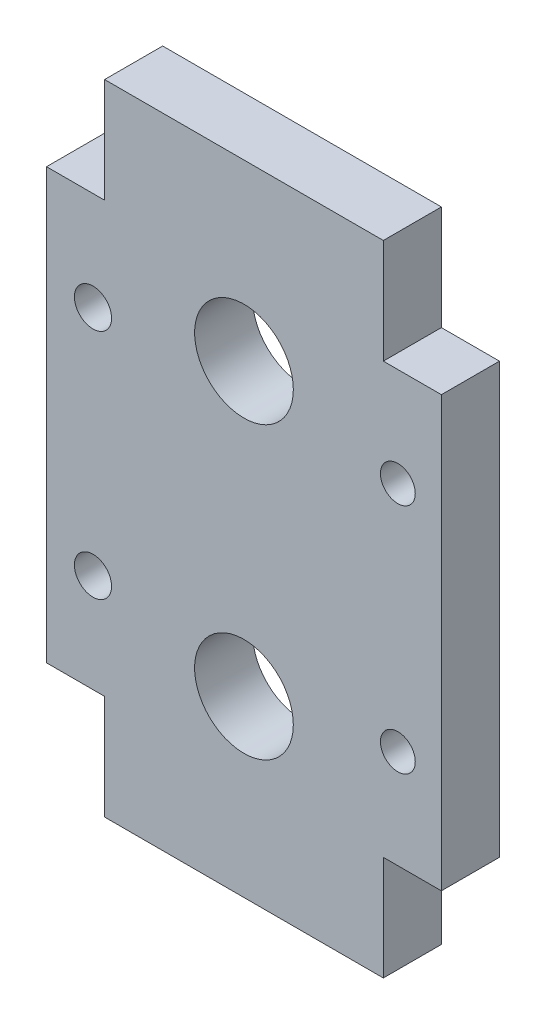
ISO-10303-21;
HEADER;
FILE_DESCRIPTION(('STEP AP214'),'2;1');
FILE_NAME('part.step','',(''),(''),'','','');
FILE_SCHEMA(('AUTOMOTIVE_DESIGN { 1 0 10303 214 1 1 1 1 }'));
ENDSEC;
DATA;
#1=APPLICATION_CONTEXT('core data for automotive mechanical design processes');
#2=APPLICATION_PROTOCOL_DEFINITION('international standard','automotive_design',2000,#1);
#3=PRODUCT_CONTEXT('',#1,'mechanical');
#4=PRODUCT('Part','Part','',(#3));
#5=PRODUCT_RELATED_PRODUCT_CATEGORY('part','',(#4));
#6=PRODUCT_DEFINITION_FORMATION('','',#4);
#7=PRODUCT_DEFINITION_CONTEXT('part definition',#1,'design');
#8=PRODUCT_DEFINITION('design','',#6,#7);
#9=PRODUCT_DEFINITION_SHAPE('','',#8);
#10=(LENGTH_UNIT() NAMED_UNIT(*) SI_UNIT(.MILLI.,.METRE.));
#11=(NAMED_UNIT(*) PLANE_ANGLE_UNIT() SI_UNIT($,.RADIAN.));
#12=(NAMED_UNIT(*) SI_UNIT($,.STERADIAN.) SOLID_ANGLE_UNIT());
#13=UNCERTAINTY_MEASURE_WITH_UNIT(LENGTH_MEASURE(1.E-05),#10,'distance_accuracy_value','');
#14=(GEOMETRIC_REPRESENTATION_CONTEXT(3) GLOBAL_UNCERTAINTY_ASSIGNED_CONTEXT((#13)) GLOBAL_UNIT_ASSIGNED_CONTEXT((#10,
#11,#12)) REPRESENTATION_CONTEXT('',''));
#15=CARTESIAN_POINT('',(0.,0.,0.));
#16=DIRECTION('',(0.,0.,1.));
#17=DIRECTION('',(1.,0.,0.));
#18=AXIS2_PLACEMENT_3D('',#15,#16,#17);
#19=CARTESIAN_POINT('',(16.700860260171,3.2922916539892,5.));
#20=DIRECTION('',(0.,0.,1.));
#21=DIRECTION('',(1.,0.,0.));
#22=AXIS2_PLACEMENT_3D('',#19,#20,#21);
#23=PLANE('',#22);
#24=DIRECTION('',(0.,1.,0.));
#25=VECTOR('',#24,1.);
#26=CARTESIAN_POINT('',(16.5009159395274,20.7922916539892,5.));
#27=LINE('',#26,#25);
#28=CARTESIAN_POINT('',(16.5009159395274,-16.2077083460108,5.));
#29=VERTEX_POINT('',#28);
#30=CARTESIAN_POINT('',(16.5009159395274,20.7922916539892,5.));
#31=VERTEX_POINT('',#30);
#32=EDGE_CURVE('E119',#29,#31,#27,.T.);
#33=ORIENTED_EDGE('',*,*,#32,.F.);
#34=DIRECTION('',(-1.,0.,0.));
#35=VECTOR('',#34,1.);
#36=CARTESIAN_POINT('',(16.700860260171,-16.2077083460108,5.));
#37=LINE('',#36,#35);
#38=CARTESIAN_POINT('',(21.5009159395274,-16.2077083460108,5.));
#39=VERTEX_POINT('',#38);
#40=EDGE_CURVE('E123',#39,#29,#37,.T.);
#41=ORIENTED_EDGE('',*,*,#40,.F.);
#42=DIRECTION('',(0.,1.,0.));
#43=VECTOR('',#42,1.);
#44=CARTESIAN_POINT('',(21.5009159395274,-25.2077083460108,5.));
#45=LINE('',#44,#43);
#46=CARTESIAN_POINT('',(21.5009159395274,-25.2077083460108,5.));
#47=VERTEX_POINT('',#46);
#48=EDGE_CURVE('E222',#47,#39,#45,.T.);
#49=ORIENTED_EDGE('',*,*,#48,.F.);
#50=DIRECTION('',(1.,0.,0.));
#51=VECTOR('',#50,1.);
#52=CARTESIAN_POINT('',(26.2509159395273,-25.2077083460108,5.));
#53=LINE('',#52,#51);
#54=CARTESIAN_POINT('',(45.5009159395274,-25.2077083460108,5.));
#55=VERTEX_POINT('',#54);
#56=EDGE_CURVE('E11',#47,#55,#53,.T.);
#57=ORIENTED_EDGE('',*,*,#56,.T.);
#58=DIRECTION('',(0.,-1.,0.));
#59=VECTOR('',#58,1.);
#60=CARTESIAN_POINT('',(45.5009159395274,-25.2077083460108,5.));
#61=LINE('',#60,#59);
#62=CARTESIAN_POINT('',(45.5009159395274,-16.2077083460108,5.));
#63=VERTEX_POINT('',#62);
#64=EDGE_CURVE('E213',#63,#55,#61,.T.);
#65=ORIENTED_EDGE('',*,*,#64,.F.);
#66=DIRECTION('',(-1.,0.,0.));
#67=VECTOR('',#66,1.);
#68=CARTESIAN_POINT('',(50.0009159395274,-16.2077083460108,5.));
#69=LINE('',#68,#67);
#70=CARTESIAN_POINT('',(50.5009159395274,-16.2077083460108,5.));
#71=VERTEX_POINT('',#70);
#72=EDGE_CURVE('E173',#71,#63,#69,.T.);
#73=ORIENTED_EDGE('',*,*,#72,.F.);
#74=DIRECTION('',(0.,-1.,0.));
#75=VECTOR('',#74,1.);
#76=CARTESIAN_POINT('',(50.5009159395274,-16.2077083460108,5.));
#77=LINE('',#76,#75);
#78=CARTESIAN_POINT('',(50.5009159395274,20.7922916539892,5.));
#79=VERTEX_POINT('',#78);
#80=EDGE_CURVE('E170',#79,#71,#77,.T.);
#81=ORIENTED_EDGE('',*,*,#80,.F.);
#82=DIRECTION('',(1.,0.,0.));
#83=VECTOR('',#82,1.);
#84=CARTESIAN_POINT('',(50.5009159395274,20.7922916539892,5.));
#85=LINE('',#84,#83);
#86=CARTESIAN_POINT('',(45.5009159395274,20.7922916539892,5.));
#87=VERTEX_POINT('',#86);
#88=EDGE_CURVE('E177',#87,#79,#85,.T.);
#89=ORIENTED_EDGE('',*,*,#88,.F.);
#90=DIRECTION('',(0.,-1.,0.));
#91=VECTOR('',#90,1.);
#92=CARTESIAN_POINT('',(45.5009159395274,29.1887382633958,5.));
#93=LINE('',#92,#91);
#94=CARTESIAN_POINT('',(45.5009159395274,29.7922916539892,5.));
#95=VERTEX_POINT('',#94);
#96=EDGE_CURVE('E199',#95,#87,#93,.T.);
#97=ORIENTED_EDGE('',*,*,#96,.F.);
#98=DIRECTION('',(1.,0.,0.));
#99=VECTOR('',#98,1.);
#100=CARTESIAN_POINT('',(45.5009159395274,29.7922916539892,5.));
#101=LINE('',#100,#99);
#102=CARTESIAN_POINT('',(21.5009159395274,29.7922916539892,5.));
#103=VERTEX_POINT('',#102);
#104=EDGE_CURVE('E195',#103,#95,#101,.T.);
#105=ORIENTED_EDGE('',*,*,#104,.F.);
#106=DIRECTION('',(0.,1.,0.));
#107=VECTOR('',#106,1.);
#108=CARTESIAN_POINT('',(21.5009159395274,29.7922916539892,5.));
#109=LINE('',#108,#107);
#110=CARTESIAN_POINT('',(21.5009159395274,20.7922916539891,5.));
#111=VERTEX_POINT('',#110);
#112=EDGE_CURVE('E192',#111,#103,#109,.T.);
#113=ORIENTED_EDGE('',*,*,#112,.F.);
#114=DIRECTION('',(1.,0.,0.));
#115=VECTOR('',#114,1.);
#116=CARTESIAN_POINT('',(16.700860260171,20.7922916539891,5.));
#117=LINE('',#116,#115);
#118=EDGE_CURVE('E125',#31,#111,#117,.T.);
#119=ORIENTED_EDGE('',*,*,#118,.F.);
#120=EDGE_LOOP('',(#33,#41,#49,#57,#65,#73,#81,#89,#97,#105,#113,#119));
#121=FACE_BOUND('',#120,.T.);
#122=CARTESIAN_POINT('',(20.5009159395274,-7.70770834601083,5.));
#123=DIRECTION('',(0.,0.,1.));
#124=DIRECTION('',(1.,0.,0.));
#125=AXIS2_PLACEMENT_3D('',#122,#123,#124);
#126=CIRCLE('',#125,1.6);
#127=CARTESIAN_POINT('',(22.1009159395274,-7.70770834601083,5.));
#128=VERTEX_POINT('',#127);
#129=EDGE_CURVE('E354',#128,#128,#126,.T.);
#130=ORIENTED_EDGE('',*,*,#129,.F.);
#131=EDGE_LOOP('',(#130));
#132=FACE_BOUND('',#131,.T.);
#133=CARTESIAN_POINT('',(20.5009159395274,12.2922916539892,5.));
#134=DIRECTION('',(0.,0.,1.));
#135=DIRECTION('',(1.,0.,0.));
#136=AXIS2_PLACEMENT_3D('',#133,#134,#135);
#137=CIRCLE('',#136,1.6);
#138=CARTESIAN_POINT('',(22.1009159395274,12.2922916539892,5.));
#139=VERTEX_POINT('',#138);
#140=EDGE_CURVE('E356',#139,#139,#137,.T.);
#141=ORIENTED_EDGE('',*,*,#140,.F.);
#142=EDGE_LOOP('',(#141));
#143=FACE_BOUND('',#142,.T.);
#144=CARTESIAN_POINT('',(33.5009159395274,-10.2077083460108,5.));
#145=DIRECTION('',(0.,0.,1.));
#146=DIRECTION('',(1.,0.,0.));
#147=AXIS2_PLACEMENT_3D('',#144,#145,#146);
#148=CIRCLE('',#147,4.25000000000001);
#149=CARTESIAN_POINT('',(37.7509159395274,-10.2077083460108,5.));
#150=VERTEX_POINT('',#149);
#151=EDGE_CURVE('E228',#150,#150,#148,.T.);
#152=ORIENTED_EDGE('',*,*,#151,.F.);
#153=EDGE_LOOP('',(#152));
#154=FACE_BOUND('',#153,.T.);
#155=CARTESIAN_POINT('',(46.7509159395274,12.2922916539892,5.));
#156=DIRECTION('',(0.,0.,1.));
#157=DIRECTION('',(1.,0.,0.));
#158=AXIS2_PLACEMENT_3D('',#155,#156,#157);
#159=CIRCLE('',#158,1.5);
#160=CARTESIAN_POINT('',(48.2509159395274,12.2922916539892,5.));
#161=VERTEX_POINT('',#160);
#162=EDGE_CURVE('E240',#161,#161,#159,.T.);
#163=ORIENTED_EDGE('',*,*,#162,.F.);
#164=EDGE_LOOP('',(#163));
#165=FACE_BOUND('',#164,.T.);
#166=CARTESIAN_POINT('',(46.7509159395274,-7.70770834601081,5.));
#167=DIRECTION('',(0.,0.,1.));
#168=DIRECTION('',(1.,0.,0.));
#169=AXIS2_PLACEMENT_3D('',#166,#167,#168);
#170=CIRCLE('',#169,1.5);
#171=CARTESIAN_POINT('',(48.2509159395274,-7.70770834601081,5.));
#172=VERTEX_POINT('',#171);
#173=EDGE_CURVE('E246',#172,#172,#170,.T.);
#174=ORIENTED_EDGE('',*,*,#173,.F.);
#175=EDGE_LOOP('',(#174));
#176=FACE_BOUND('',#175,.T.);
#177=CARTESIAN_POINT('',(33.5009159395274,14.7922916539892,5.));
#178=DIRECTION('',(0.,0.,1.));
#179=DIRECTION('',(1.,0.,0.));
#180=AXIS2_PLACEMENT_3D('',#177,#178,#179);
#181=CIRCLE('',#180,4.25);
#182=CARTESIAN_POINT('',(37.7509159395274,14.7922916539892,5.));
#183=VERTEX_POINT('',#182);
#184=EDGE_CURVE('E234',#183,#183,#181,.T.);
#185=ORIENTED_EDGE('',*,*,#184,.F.);
#186=EDGE_LOOP('',(#185));
#187=FACE_BOUND('',#186,.T.);
#188=ADVANCED_FACE('F35',(#121,#132,#143,#154,#165,#176,#187),#23,.T.);
#189=CARTESIAN_POINT('',(16.700860260171,3.2922916539892,0.));
#190=DIRECTION('',(0.,0.,1.));
#191=DIRECTION('',(1.,0.,0.));
#192=AXIS2_PLACEMENT_3D('',#189,#190,#191);
#193=PLANE('',#192);
#194=DIRECTION('',(1.,0.,0.));
#195=VECTOR('',#194,1.);
#196=CARTESIAN_POINT('',(21.2509159395274,-16.2077083460108,0.));
#197=LINE('',#196,#195);
#198=CARTESIAN_POINT('',(16.5009159395274,-16.2077083460108,0.));
#199=VERTEX_POINT('',#198);
#200=CARTESIAN_POINT('',(21.5009159395274,-16.2077083460108,0.));
#201=VERTEX_POINT('',#200);
#202=EDGE_CURVE('E160',#199,#201,#197,.T.);
#203=ORIENTED_EDGE('',*,*,#202,.F.);
#204=DIRECTION('',(0.,1.,0.));
#205=VECTOR('',#204,1.);
#206=CARTESIAN_POINT('',(16.5009159395274,20.7922916539892,0.));
#207=LINE('',#206,#205);
#208=CARTESIAN_POINT('',(16.5009159395274,20.7922916539892,0.));
#209=VERTEX_POINT('',#208);
#210=EDGE_CURVE('E131',#199,#209,#207,.T.);
#211=ORIENTED_EDGE('',*,*,#210,.T.);
#212=DIRECTION('',(-1.,0.,0.));
#213=VECTOR('',#212,1.);
#214=CARTESIAN_POINT('',(21.5009159395274,20.7922916539891,0.));
#215=LINE('',#214,#213);
#216=CARTESIAN_POINT('',(21.5009159395274,20.7922916539891,0.));
#217=VERTEX_POINT('',#216);
#218=EDGE_CURVE('E155',#217,#209,#215,.T.);
#219=ORIENTED_EDGE('',*,*,#218,.F.);
#220=DIRECTION('',(0.,1.,0.));
#221=VECTOR('',#220,1.);
#222=CARTESIAN_POINT('',(21.5009159395274,29.7922916539892,0.));
#223=LINE('',#222,#221);
#224=CARTESIAN_POINT('',(21.5009159395274,29.7922916539892,0.));
#225=VERTEX_POINT('',#224);
#226=EDGE_CURVE('E190',#217,#225,#223,.T.);
#227=ORIENTED_EDGE('',*,*,#226,.T.);
#228=DIRECTION('',(1.,0.,0.));
#229=VECTOR('',#228,1.);
#230=CARTESIAN_POINT('',(45.5009159395274,29.7922916539892,0.));
#231=LINE('',#230,#229);
#232=CARTESIAN_POINT('',(45.5009159395274,29.7922916539892,0.));
#233=VERTEX_POINT('',#232);
#234=EDGE_CURVE('E205',#225,#233,#231,.T.);
#235=ORIENTED_EDGE('',*,*,#234,.T.);
#236=DIRECTION('',(0.,-1.,0.));
#237=VECTOR('',#236,1.);
#238=CARTESIAN_POINT('',(45.5009159395274,29.1887382633958,0.));
#239=LINE('',#238,#237);
#240=CARTESIAN_POINT('',(45.5009159395274,20.7922916539892,0.));
#241=VERTEX_POINT('',#240);
#242=EDGE_CURVE('E196',#233,#241,#239,.T.);
#243=ORIENTED_EDGE('',*,*,#242,.T.);
#244=DIRECTION('',(1.,0.,0.));
#245=VECTOR('',#244,1.);
#246=CARTESIAN_POINT('',(50.5009159395274,20.7922916539892,0.));
#247=LINE('',#246,#245);
#248=CARTESIAN_POINT('',(50.5009159395274,20.7922916539892,0.));
#249=VERTEX_POINT('',#248);
#250=EDGE_CURVE('E174',#241,#249,#247,.T.);
#251=ORIENTED_EDGE('',*,*,#250,.T.);
#252=DIRECTION('',(0.,-1.,0.));
#253=VECTOR('',#252,1.);
#254=CARTESIAN_POINT('',(50.5009159395274,-16.2077083460108,0.));
#255=LINE('',#254,#253);
#256=CARTESIAN_POINT('',(50.5009159395274,-16.2077083460108,0.));
#257=VERTEX_POINT('',#256);
#258=EDGE_CURVE('E169',#249,#257,#255,.T.);
#259=ORIENTED_EDGE('',*,*,#258,.T.);
#260=DIRECTION('',(-1.,0.,0.));
#261=VECTOR('',#260,1.);
#262=CARTESIAN_POINT('',(50.0009159395274,-16.2077083460108,0.));
#263=LINE('',#262,#261);
#264=CARTESIAN_POINT('',(45.5009159395274,-16.2077083460108,0.));
#265=VERTEX_POINT('',#264);
#266=EDGE_CURVE('E183',#257,#265,#263,.T.);
#267=ORIENTED_EDGE('',*,*,#266,.T.);
#268=DIRECTION('',(0.,-1.,0.));
#269=VECTOR('',#268,1.);
#270=CARTESIAN_POINT('',(45.5009159395274,-25.2077083460108,0.));
#271=LINE('',#270,#269);
#272=CARTESIAN_POINT('',(45.5009159395274,-25.2077083460108,0.));
#273=VERTEX_POINT('',#272);
#274=EDGE_CURVE('E211',#265,#273,#271,.T.);
#275=ORIENTED_EDGE('',*,*,#274,.T.);
#276=DIRECTION('',(1.,0.,0.));
#277=VECTOR('',#276,1.);
#278=CARTESIAN_POINT('',(26.2509159395273,-25.2077083460108,0.));
#279=LINE('',#278,#277);
#280=CARTESIAN_POINT('',(21.5009159395274,-25.2077083460108,0.));
#281=VERTEX_POINT('',#280);
#282=EDGE_CURVE('E39',#281,#273,#279,.T.);
#283=ORIENTED_EDGE('',*,*,#282,.F.);
#284=DIRECTION('',(0.,1.,0.));
#285=VECTOR('',#284,1.);
#286=CARTESIAN_POINT('',(21.5009159395274,-25.2077083460108,0.));
#287=LINE('',#286,#285);
#288=EDGE_CURVE('E221',#281,#201,#287,.T.);
#289=ORIENTED_EDGE('',*,*,#288,.T.);
#290=EDGE_LOOP('',(#203,#211,#219,#227,#235,#243,#251,#259,#267,#275,#283,#289));
#291=FACE_BOUND('',#290,.T.);
#292=CARTESIAN_POINT('',(46.7509159395274,-7.70770834601081,0.));
#293=DIRECTION('',(0.,0.,1.));
#294=DIRECTION('',(1.,0.,0.));
#295=AXIS2_PLACEMENT_3D('',#292,#293,#294);
#296=CIRCLE('',#295,1.5);
#297=CARTESIAN_POINT('',(48.2509159395274,-7.70770834601081,0.));
#298=VERTEX_POINT('',#297);
#299=EDGE_CURVE('E243',#298,#298,#296,.T.);
#300=ORIENTED_EDGE('',*,*,#299,.T.);
#301=EDGE_LOOP('',(#300));
#302=FACE_BOUND('',#301,.T.);
#303=CARTESIAN_POINT('',(46.7509159395274,12.2922916539892,0.));
#304=DIRECTION('',(0.,0.,1.));
#305=DIRECTION('',(1.,0.,0.));
#306=AXIS2_PLACEMENT_3D('',#303,#304,#305);
#307=CIRCLE('',#306,1.5);
#308=CARTESIAN_POINT('',(48.2509159395274,12.2922916539892,0.));
#309=VERTEX_POINT('',#308);
#310=EDGE_CURVE('E237',#309,#309,#307,.T.);
#311=ORIENTED_EDGE('',*,*,#310,.T.);
#312=EDGE_LOOP('',(#311));
#313=FACE_BOUND('',#312,.T.);
#314=CARTESIAN_POINT('',(33.5009159395274,14.7922916539892,0.));
#315=DIRECTION('',(0.,0.,1.));
#316=DIRECTION('',(1.,0.,0.));
#317=AXIS2_PLACEMENT_3D('',#314,#315,#316);
#318=CIRCLE('',#317,4.25);
#319=CARTESIAN_POINT('',(37.7509159395274,14.7922916539892,0.));
#320=VERTEX_POINT('',#319);
#321=EDGE_CURVE('E231',#320,#320,#318,.T.);
#322=ORIENTED_EDGE('',*,*,#321,.T.);
#323=EDGE_LOOP('',(#322));
#324=FACE_BOUND('',#323,.T.);
#325=CARTESIAN_POINT('',(33.5009159395274,-10.2077083460108,0.));
#326=DIRECTION('',(0.,0.,1.));
#327=DIRECTION('',(1.,0.,0.));
#328=AXIS2_PLACEMENT_3D('',#325,#326,#327);
#329=CIRCLE('',#328,4.25000000000001);
#330=CARTESIAN_POINT('',(37.7509159395274,-10.2077083460108,0.));
#331=VERTEX_POINT('',#330);
#332=EDGE_CURVE('E227',#331,#331,#329,.T.);
#333=ORIENTED_EDGE('',*,*,#332,.T.);
#334=EDGE_LOOP('',(#333));
#335=FACE_BOUND('',#334,.T.);
#336=CARTESIAN_POINT('',(20.5009159395274,12.2922916539892,0.));
#337=DIRECTION('',(0.,0.,1.));
#338=DIRECTION('',(1.,0.,0.));
#339=AXIS2_PLACEMENT_3D('',#336,#337,#338);
#340=CIRCLE('',#339,1.6);
#341=CARTESIAN_POINT('',(22.1009159395274,12.2922916539892,0.));
#342=VERTEX_POINT('',#341);
#343=EDGE_CURVE('E146',#342,#342,#340,.T.);
#344=ORIENTED_EDGE('',*,*,#343,.T.);
#345=EDGE_LOOP('',(#344));
#346=FACE_BOUND('',#345,.T.);
#347=CARTESIAN_POINT('',(20.5009159395274,-7.70770834601083,0.));
#348=DIRECTION('',(0.,0.,1.));
#349=DIRECTION('',(1.,0.,0.));
#350=AXIS2_PLACEMENT_3D('',#347,#348,#349);
#351=CIRCLE('',#350,1.6);
#352=CARTESIAN_POINT('',(22.1009159395274,-7.70770834601083,0.));
#353=VERTEX_POINT('',#352);
#354=EDGE_CURVE('E150',#353,#353,#351,.T.);
#355=ORIENTED_EDGE('',*,*,#354,.T.);
#356=EDGE_LOOP('',(#355));
#357=FACE_BOUND('',#356,.T.);
#358=ADVANCED_FACE('F252',(#291,#302,#313,#324,#335,#346,#357),#193,.F.);
#359=CARTESIAN_POINT('',(26.2509159395273,-25.2077083460108,5.));
#360=DIRECTION('',(0.,1.,0.));
#361=DIRECTION('',(0.,0.,1.));
#362=AXIS2_PLACEMENT_3D('',#359,#360,#361);
#363=PLANE('',#362);
#364=ORIENTED_EDGE('',*,*,#282,.T.);
#365=DIRECTION('',(0.,0.,-1.));
#366=VECTOR('',#365,1.);
#367=CARTESIAN_POINT('',(45.5009159395274,-25.2077083460108,5.));
#368=LINE('',#367,#366);
#369=EDGE_CURVE('E216',#55,#273,#368,.T.);
#370=ORIENTED_EDGE('',*,*,#369,.F.);
#371=ORIENTED_EDGE('',*,*,#56,.F.);
#372=DIRECTION('',(0.,0.,-1.));
#373=VECTOR('',#372,1.);
#374=CARTESIAN_POINT('',(21.5009159395274,-25.2077083460108,5.));
#375=LINE('',#374,#373);
#376=EDGE_CURVE('E224',#47,#281,#375,.T.);
#377=ORIENTED_EDGE('',*,*,#376,.T.);
#378=EDGE_LOOP('',(#364,#370,#371,#377));
#379=FACE_BOUND('',#378,.T.);
#380=ADVANCED_FACE('F37',(#379),#363,.F.);
#381=CARTESIAN_POINT('',(46.7509159395274,-7.70770834601081,5.));
#382=DIRECTION('',(0.,0.,-1.));
#383=DIRECTION('',(-1.,0.,0.));
#384=AXIS2_PLACEMENT_3D('',#381,#382,#383);
#385=CYLINDRICAL_SURFACE('',#384,1.5);
#386=ORIENTED_EDGE('',*,*,#173,.T.);
#387=EDGE_LOOP('',(#386));
#388=FACE_BOUND('',#387,.T.);
#389=ORIENTED_EDGE('',*,*,#299,.F.);
#390=EDGE_LOOP('',(#389));
#391=FACE_BOUND('',#390,.T.);
#392=ADVANCED_FACE('F255',(#388,#391),#385,.F.);
#393=CARTESIAN_POINT('',(46.7509159395274,12.2922916539892,5.));
#394=DIRECTION('',(0.,0.,-1.));
#395=DIRECTION('',(-1.,0.,0.));
#396=AXIS2_PLACEMENT_3D('',#393,#394,#395);
#397=CYLINDRICAL_SURFACE('',#396,1.5);
#398=ORIENTED_EDGE('',*,*,#162,.T.);
#399=EDGE_LOOP('',(#398));
#400=FACE_BOUND('',#399,.T.);
#401=ORIENTED_EDGE('',*,*,#310,.F.);
#402=EDGE_LOOP('',(#401));
#403=FACE_BOUND('',#402,.T.);
#404=ADVANCED_FACE('F257',(#400,#403),#397,.F.);
#405=CARTESIAN_POINT('',(33.5009159395274,14.7922916539892,5.));
#406=DIRECTION('',(0.,0.,-1.));
#407=DIRECTION('',(-1.,0.,0.));
#408=AXIS2_PLACEMENT_3D('',#405,#406,#407);
#409=CYLINDRICAL_SURFACE('',#408,4.25);
#410=ORIENTED_EDGE('',*,*,#184,.T.);
#411=EDGE_LOOP('',(#410));
#412=FACE_BOUND('',#411,.T.);
#413=ORIENTED_EDGE('',*,*,#321,.F.);
#414=EDGE_LOOP('',(#413));
#415=FACE_BOUND('',#414,.T.);
#416=ADVANCED_FACE('F264',(#412,#415),#409,.F.);
#417=CARTESIAN_POINT('',(33.5009159395274,-10.2077083460108,5.));
#418=DIRECTION('',(0.,0.,-1.));
#419=DIRECTION('',(-1.,0.,0.));
#420=AXIS2_PLACEMENT_3D('',#417,#418,#419);
#421=CYLINDRICAL_SURFACE('',#420,4.25000000000001);
#422=ORIENTED_EDGE('',*,*,#151,.T.);
#423=EDGE_LOOP('',(#422));
#424=FACE_BOUND('',#423,.T.);
#425=ORIENTED_EDGE('',*,*,#332,.F.);
#426=EDGE_LOOP('',(#425));
#427=FACE_BOUND('',#426,.T.);
#428=ADVANCED_FACE('F334',(#424,#427),#421,.F.);
#429=CARTESIAN_POINT('',(21.5009159395274,-25.2077083460108,5.));
#430=DIRECTION('',(-1.,0.,0.));
#431=DIRECTION('',(0.,-1.,0.));
#432=AXIS2_PLACEMENT_3D('',#429,#430,#431);
#433=PLANE('',#432);
#434=ORIENTED_EDGE('',*,*,#288,.F.);
#435=ORIENTED_EDGE('',*,*,#376,.F.);
#436=ORIENTED_EDGE('',*,*,#48,.T.);
#437=DIRECTION('',(0.,0.,-1.));
#438=VECTOR('',#437,1.);
#439=CARTESIAN_POINT('',(21.5009159395274,-16.2077083460108,10.));
#440=LINE('',#439,#438);
#441=EDGE_CURVE('E140',#39,#201,#440,.T.);
#442=ORIENTED_EDGE('',*,*,#441,.T.);
#443=EDGE_LOOP('',(#434,#435,#436,#442));
#444=FACE_BOUND('',#443,.T.);
#445=ADVANCED_FACE('F280',(#444),#433,.T.);
#446=CARTESIAN_POINT('',(45.5009159395274,-25.2077083460108,5.));
#447=DIRECTION('',(1.,0.,0.));
#448=DIRECTION('',(0.,0.,-1.));
#449=AXIS2_PLACEMENT_3D('',#446,#447,#448);
#450=PLANE('',#449);
#451=ORIENTED_EDGE('',*,*,#274,.F.);
#452=DIRECTION('',(0.,0.,-1.));
#453=VECTOR('',#452,1.);
#454=CARTESIAN_POINT('',(45.5009159395274,-16.2077083460108,10.));
#455=LINE('',#454,#453);
#456=EDGE_CURVE('E141',#63,#265,#455,.T.);
#457=ORIENTED_EDGE('',*,*,#456,.F.);
#458=ORIENTED_EDGE('',*,*,#64,.T.);
#459=ORIENTED_EDGE('',*,*,#369,.T.);
#460=EDGE_LOOP('',(#451,#457,#458,#459));
#461=FACE_BOUND('',#460,.T.);
#462=ADVANCED_FACE('F284',(#461),#450,.T.);
#463=CARTESIAN_POINT('',(45.5009159395274,29.1887382633958,5.));
#464=DIRECTION('',(1.,0.,0.));
#465=DIRECTION('',(0.,0.,-1.));
#466=AXIS2_PLACEMENT_3D('',#463,#464,#465);
#467=PLANE('',#466);
#468=ORIENTED_EDGE('',*,*,#242,.F.);
#469=DIRECTION('',(0.,0.,-1.));
#470=VECTOR('',#469,1.);
#471=CARTESIAN_POINT('',(45.5009159395274,29.7922916539892,5.));
#472=LINE('',#471,#470);
#473=EDGE_CURVE('E209',#95,#233,#472,.T.);
#474=ORIENTED_EDGE('',*,*,#473,.F.);
#475=ORIENTED_EDGE('',*,*,#96,.T.);
#476=DIRECTION('',(0.,0.,-1.));
#477=VECTOR('',#476,1.);
#478=CARTESIAN_POINT('',(45.5009159395274,20.7922916539892,10.));
#479=LINE('',#478,#477);
#480=EDGE_CURVE('E161',#87,#241,#479,.T.);
#481=ORIENTED_EDGE('',*,*,#480,.T.);
#482=EDGE_LOOP('',(#468,#474,#475,#481));
#483=FACE_BOUND('',#482,.T.);
#484=ADVANCED_FACE('F300',(#483),#467,.T.);
#485=CARTESIAN_POINT('',(45.5009159395274,29.7922916539892,5.));
#486=DIRECTION('',(0.,1.,0.));
#487=DIRECTION('',(-1.,0.,0.));
#488=AXIS2_PLACEMENT_3D('',#485,#486,#487);
#489=PLANE('',#488);
#490=ORIENTED_EDGE('',*,*,#234,.F.);
#491=DIRECTION('',(0.,0.,-1.));
#492=VECTOR('',#491,1.);
#493=CARTESIAN_POINT('',(21.5009159395274,29.7922916539892,5.));
#494=LINE('',#493,#492);
#495=EDGE_CURVE('E202',#103,#225,#494,.T.);
#496=ORIENTED_EDGE('',*,*,#495,.F.);
#497=ORIENTED_EDGE('',*,*,#104,.T.);
#498=ORIENTED_EDGE('',*,*,#473,.T.);
#499=EDGE_LOOP('',(#490,#496,#497,#498));
#500=FACE_BOUND('',#499,.T.);
#501=ADVANCED_FACE('F303',(#500),#489,.T.);
#502=CARTESIAN_POINT('',(21.5009159395274,29.7922916539892,5.));
#503=DIRECTION('',(-1.,0.,0.));
#504=DIRECTION('',(0.,0.,1.));
#505=AXIS2_PLACEMENT_3D('',#502,#503,#504);
#506=PLANE('',#505);
#507=ORIENTED_EDGE('',*,*,#226,.F.);
#508=DIRECTION('',(0.,0.,-1.));
#509=VECTOR('',#508,1.);
#510=CARTESIAN_POINT('',(21.5009159395274,20.7922916539891,10.));
#511=LINE('',#510,#509);
#512=EDGE_CURVE('E157',#111,#217,#511,.T.);
#513=ORIENTED_EDGE('',*,*,#512,.F.);
#514=ORIENTED_EDGE('',*,*,#112,.T.);
#515=ORIENTED_EDGE('',*,*,#495,.T.);
#516=EDGE_LOOP('',(#507,#513,#514,#515));
#517=FACE_BOUND('',#516,.T.);
#518=ADVANCED_FACE('F306',(#517),#506,.T.);
#519=CARTESIAN_POINT('',(50.5009159395274,-16.2077083460108,5.));
#520=DIRECTION('',(1.,0.,0.));
#521=DIRECTION('',(0.,1.,0.));
#522=AXIS2_PLACEMENT_3D('',#519,#520,#521);
#523=PLANE('',#522);
#524=ORIENTED_EDGE('',*,*,#258,.F.);
#525=DIRECTION('',(0.,0.,-1.));
#526=VECTOR('',#525,1.);
#527=CARTESIAN_POINT('',(50.5009159395274,20.7922916539892,5.));
#528=LINE('',#527,#526);
#529=EDGE_CURVE('E188',#79,#249,#528,.T.);
#530=ORIENTED_EDGE('',*,*,#529,.F.);
#531=ORIENTED_EDGE('',*,*,#80,.T.);
#532=DIRECTION('',(0.,0.,-1.));
#533=VECTOR('',#532,1.);
#534=CARTESIAN_POINT('',(50.5009159395274,-16.2077083460108,5.));
#535=LINE('',#534,#533);
#536=EDGE_CURVE('E180',#71,#257,#535,.T.);
#537=ORIENTED_EDGE('',*,*,#536,.T.);
#538=EDGE_LOOP('',(#524,#530,#531,#537));
#539=FACE_BOUND('',#538,.T.);
#540=ADVANCED_FACE('F291',(#539),#523,.T.);
#541=CARTESIAN_POINT('',(50.5009159395274,20.7922916539892,5.));
#542=DIRECTION('',(0.,1.,0.));
#543=DIRECTION('',(0.,0.,1.));
#544=AXIS2_PLACEMENT_3D('',#541,#542,#543);
#545=PLANE('',#544);
#546=ORIENTED_EDGE('',*,*,#250,.F.);
#547=ORIENTED_EDGE('',*,*,#480,.F.);
#548=ORIENTED_EDGE('',*,*,#88,.T.);
#549=ORIENTED_EDGE('',*,*,#529,.T.);
#550=EDGE_LOOP('',(#546,#547,#548,#549));
#551=FACE_BOUND('',#550,.T.);
#552=ADVANCED_FACE('F294',(#551),#545,.T.);
#553=CARTESIAN_POINT('',(50.0009159395274,-16.2077083460108,5.));
#554=DIRECTION('',(0.,-1.,0.));
#555=DIRECTION('',(1.,0.,0.));
#556=AXIS2_PLACEMENT_3D('',#553,#554,#555);
#557=PLANE('',#556);
#558=ORIENTED_EDGE('',*,*,#266,.F.);
#559=ORIENTED_EDGE('',*,*,#536,.F.);
#560=ORIENTED_EDGE('',*,*,#72,.T.);
#561=ORIENTED_EDGE('',*,*,#456,.T.);
#562=EDGE_LOOP('',(#558,#559,#560,#561));
#563=FACE_BOUND('',#562,.T.);
#564=ADVANCED_FACE('F287',(#563),#557,.T.);
#565=CARTESIAN_POINT('',(21.5009159395274,20.7922916539891,10.));
#566=DIRECTION('',(0.,-1.,0.));
#567=DIRECTION('',(0.,0.,-1.));
#568=AXIS2_PLACEMENT_3D('',#565,#566,#567);
#569=PLANE('',#568);
#570=ORIENTED_EDGE('',*,*,#118,.T.);
#571=ORIENTED_EDGE('',*,*,#512,.T.);
#572=ORIENTED_EDGE('',*,*,#218,.T.);
#573=DIRECTION('',(0.,0.,-1.));
#574=VECTOR('',#573,1.);
#575=CARTESIAN_POINT('',(16.5009159395274,20.7922916539892,5.));
#576=LINE('',#575,#574);
#577=EDGE_CURVE('E130',#31,#209,#576,.T.);
#578=ORIENTED_EDGE('',*,*,#577,.F.);
#579=EDGE_LOOP('',(#570,#571,#572,#578));
#580=FACE_BOUND('',#579,.T.);
#581=ADVANCED_FACE('F308',(#580),#569,.F.);
#582=CARTESIAN_POINT('',(21.2509159395274,-16.2077083460108,10.));
#583=DIRECTION('',(0.,1.,0.));
#584=DIRECTION('',(0.,0.,1.));
#585=AXIS2_PLACEMENT_3D('',#582,#583,#584);
#586=PLANE('',#585);
#587=ORIENTED_EDGE('',*,*,#40,.T.);
#588=DIRECTION('',(0.,0.,-1.));
#589=VECTOR('',#588,1.);
#590=CARTESIAN_POINT('',(16.5009159395274,-16.2077083460108,5.));
#591=LINE('',#590,#589);
#592=EDGE_CURVE('E138',#29,#199,#591,.T.);
#593=ORIENTED_EDGE('',*,*,#592,.T.);
#594=ORIENTED_EDGE('',*,*,#202,.T.);
#595=ORIENTED_EDGE('',*,*,#441,.F.);
#596=EDGE_LOOP('',(#587,#593,#594,#595));
#597=FACE_BOUND('',#596,.T.);
#598=ADVANCED_FACE('F136',(#597),#586,.F.);
#599=CARTESIAN_POINT('',(16.5009159395274,20.7922916539892,5.));
#600=DIRECTION('',(-1.,0.,0.));
#601=DIRECTION('',(0.,-1.,0.));
#602=AXIS2_PLACEMENT_3D('',#599,#600,#601);
#603=PLANE('',#602);
#604=ORIENTED_EDGE('',*,*,#210,.F.);
#605=ORIENTED_EDGE('',*,*,#592,.F.);
#606=ORIENTED_EDGE('',*,*,#32,.T.);
#607=ORIENTED_EDGE('',*,*,#577,.T.);
#608=EDGE_LOOP('',(#604,#605,#606,#607));
#609=FACE_BOUND('',#608,.T.);
#610=ADVANCED_FACE('F143',(#609),#603,.T.);
#611=CARTESIAN_POINT('',(20.5009159395274,-7.70770834601083,-5.));
#612=DIRECTION('',(0.,0.,1.));
#613=DIRECTION('',(1.,0.,0.));
#614=AXIS2_PLACEMENT_3D('',#611,#612,#613);
#615=CYLINDRICAL_SURFACE('',#614,1.6);
#616=ORIENTED_EDGE('',*,*,#129,.T.);
#617=EDGE_LOOP('',(#616));
#618=FACE_BOUND('',#617,.T.);
#619=ORIENTED_EDGE('',*,*,#354,.F.);
#620=EDGE_LOOP('',(#619));
#621=FACE_BOUND('',#620,.T.);
#622=ADVANCED_FACE('F376',(#618,#621),#615,.F.);
#623=CARTESIAN_POINT('',(20.5009159395274,12.2922916539892,-5.));
#624=DIRECTION('',(0.,0.,1.));
#625=DIRECTION('',(1.,0.,0.));
#626=AXIS2_PLACEMENT_3D('',#623,#624,#625);
#627=CYLINDRICAL_SURFACE('',#626,1.6);
#628=ORIENTED_EDGE('',*,*,#140,.T.);
#629=EDGE_LOOP('',(#628));
#630=FACE_BOUND('',#629,.T.);
#631=ORIENTED_EDGE('',*,*,#343,.F.);
#632=EDGE_LOOP('',(#631));
#633=FACE_BOUND('',#632,.T.);
#634=ADVANCED_FACE('F362',(#630,#633),#627,.F.);
#635=CLOSED_SHELL('',(#188,#358,#380,#392,#404,#416,#428,#445,#462,#484,#501,#518,#540,#552,
#564,#581,#598,#610,#622,#634));
#636=MANIFOLD_SOLID_BREP('B2',#635);
#637=ADVANCED_BREP_SHAPE_REPRESENTATION('',(#18,#636),#14);
#638=SHAPE_DEFINITION_REPRESENTATION(#9,#637);
ENDSEC;
END-ISO-10303-21;
